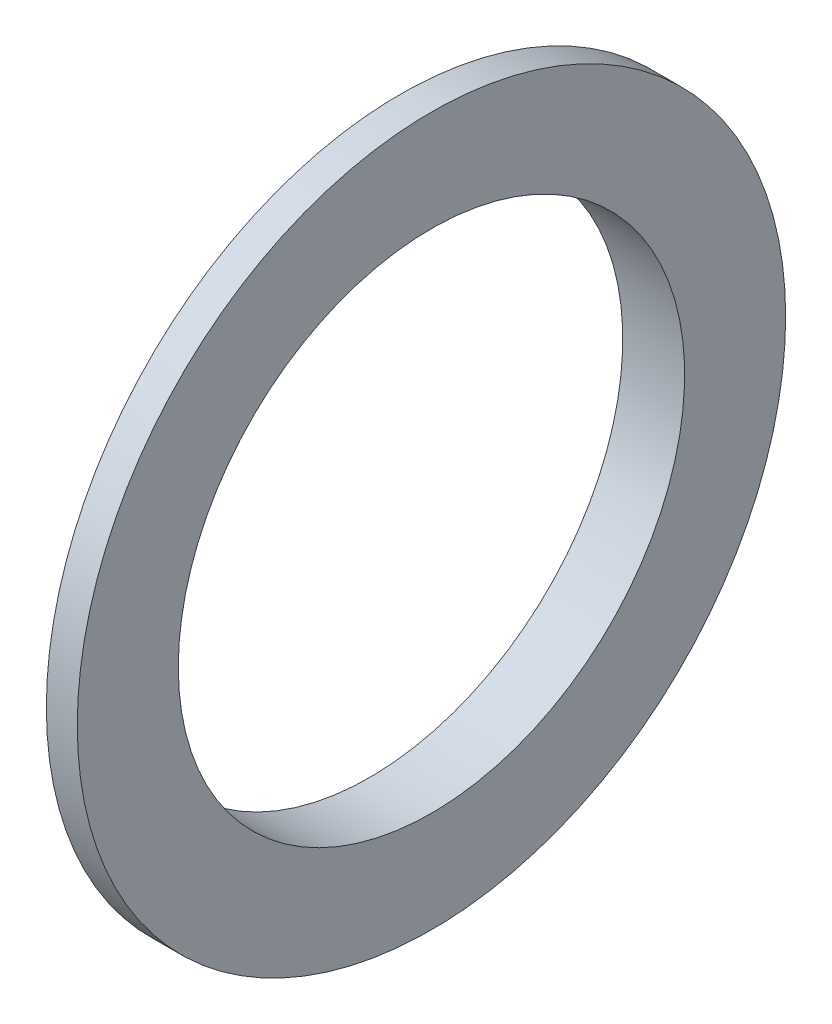
ISO-10303-21;
HEADER;
FILE_DESCRIPTION(('STEP AP214'),'2;1');
FILE_NAME('part.step','',(''),(''),'','','');
FILE_SCHEMA(('AUTOMOTIVE_DESIGN { 1 0 10303 214 1 1 1 1 }'));
ENDSEC;
DATA;
#1=APPLICATION_CONTEXT('core data for automotive mechanical design processes');
#2=APPLICATION_PROTOCOL_DEFINITION('international standard','automotive_design',2000,#1);
#3=PRODUCT_CONTEXT('',#1,'mechanical');
#4=PRODUCT('Part','Part','',(#3));
#5=PRODUCT_RELATED_PRODUCT_CATEGORY('part','',(#4));
#6=PRODUCT_DEFINITION_FORMATION('','',#4);
#7=PRODUCT_DEFINITION_CONTEXT('part definition',#1,'design');
#8=PRODUCT_DEFINITION('design','',#6,#7);
#9=PRODUCT_DEFINITION_SHAPE('','',#8);
#10=(LENGTH_UNIT() NAMED_UNIT(*) SI_UNIT(.MILLI.,.METRE.));
#11=(NAMED_UNIT(*) PLANE_ANGLE_UNIT() SI_UNIT($,.RADIAN.));
#12=(NAMED_UNIT(*) SI_UNIT($,.STERADIAN.) SOLID_ANGLE_UNIT());
#13=UNCERTAINTY_MEASURE_WITH_UNIT(LENGTH_MEASURE(1.E-05),#10,'distance_accuracy_value','');
#14=(GEOMETRIC_REPRESENTATION_CONTEXT(3) GLOBAL_UNCERTAINTY_ASSIGNED_CONTEXT((#13)) GLOBAL_UNIT_ASSIGNED_CONTEXT((#10,
#11,#12)) REPRESENTATION_CONTEXT('',''));
#15=CARTESIAN_POINT('',(0.,0.,0.));
#16=DIRECTION('',(0.,0.,1.));
#17=DIRECTION('',(1.,0.,0.));
#18=AXIS2_PLACEMENT_3D('',#15,#16,#17);
#19=CARTESIAN_POINT('',(-12.0675062027476,0.,26.9930945986634));
#20=DIRECTION('',(-1.,0.,0.));
#21=DIRECTION('',(0.,0.,1.));
#22=AXIS2_PLACEMENT_3D('',#19,#20,#21);
#23=CYLINDRICAL_SURFACE('',#22,43.2261625659578);
#24=CARTESIAN_POINT('',(-8.73505679111022,0.,26.9930945986634));
#25=DIRECTION('',(-1.,0.,0.));
#26=DIRECTION('',(0.,0.,1.));
#27=AXIS2_PLACEMENT_3D('',#24,#25,#26);
#28=CIRCLE('',#27,43.2261625659578);
#29=CARTESIAN_POINT('',(-8.73505679111022,0.,70.2192571646212));
#30=VERTEX_POINT('',#29);
#31=EDGE_CURVE('E10',#30,#30,#28,.T.);
#32=ORIENTED_EDGE('',*,*,#31,.F.);
#33=EDGE_LOOP('',(#32));
#34=FACE_BOUND('',#33,.T.);
#35=CARTESIAN_POINT('',(-4.36752839555511,0.,26.9930945986634));
#36=DIRECTION('',(-1.,0.,0.));
#37=DIRECTION('',(0.,0.,1.));
#38=AXIS2_PLACEMENT_3D('',#35,#36,#37);
#39=CIRCLE('',#38,43.2261625659578);
#40=CARTESIAN_POINT('',(-4.36752839555511,0.,70.2192571646212));
#41=VERTEX_POINT('',#40);
#42=EDGE_CURVE('E64',#41,#41,#39,.T.);
#43=ORIENTED_EDGE('',*,*,#42,.T.);
#44=EDGE_LOOP('',(#43));
#45=FACE_BOUND('',#44,.T.);
#46=ADVANCED_FACE('F37',(#34,#45),#23,.T.);
#47=CARTESIAN_POINT('',(-8.73505679111022,0.,-16.2330679672944));
#48=DIRECTION('',(1.,0.,0.));
#49=DIRECTION('',(0.,0.,-1.));
#50=AXIS2_PLACEMENT_3D('',#47,#48,#49);
#51=PLANE('',#50);
#52=CARTESIAN_POINT('',(-8.73505679111022,0.,26.9930945986634));
#53=DIRECTION('',(-1.,0.,0.));
#54=DIRECTION('',(0.,0.,1.));
#55=AXIS2_PLACEMENT_3D('',#52,#53,#54);
#56=CIRCLE('',#55,35.7410012177578);
#57=CARTESIAN_POINT('',(-8.73505679111022,0.,62.7340958164211));
#58=VERTEX_POINT('',#57);
#59=EDGE_CURVE('E44',#58,#58,#56,.T.);
#60=ORIENTED_EDGE('',*,*,#59,.F.);
#61=EDGE_LOOP('',(#60));
#62=FACE_BOUND('',#61,.T.);
#63=ORIENTED_EDGE('',*,*,#31,.T.);
#64=EDGE_LOOP('',(#63));
#65=FACE_BOUND('',#64,.T.);
#66=ADVANCED_FACE('F90',(#62,#65),#51,.F.);
#67=CARTESIAN_POINT('',(-12.0675062027476,0.,26.9930945986634));
#68=DIRECTION('',(-1.,0.,0.));
#69=DIRECTION('',(0.,0.,1.));
#70=AXIS2_PLACEMENT_3D('',#67,#68,#69);
#71=CYLINDRICAL_SURFACE('',#70,35.7410012177578);
#72=CARTESIAN_POINT('',(0.,0.,26.9930945986634));
#73=DIRECTION('',(-1.,0.,0.));
#74=DIRECTION('',(0.,0.,1.));
#75=AXIS2_PLACEMENT_3D('',#72,#73,#74);
#76=CIRCLE('',#75,35.7410012177578);
#77=CARTESIAN_POINT('',(0.,0.,62.7340958164211));
#78=VERTEX_POINT('',#77);
#79=EDGE_CURVE('E49',#78,#78,#76,.T.);
#80=ORIENTED_EDGE('',*,*,#79,.F.);
#81=EDGE_LOOP('',(#80));
#82=FACE_BOUND('',#81,.T.);
#83=ORIENTED_EDGE('',*,*,#59,.T.);
#84=EDGE_LOOP('',(#83));
#85=FACE_BOUND('',#84,.T.);
#86=ADVANCED_FACE('F85',(#82,#85),#71,.F.);
#87=CARTESIAN_POINT('',(0.,0.,-8.74790661909438));
#88=DIRECTION('',(-1.,0.,0.));
#89=DIRECTION('',(0.,0.,1.));
#90=AXIS2_PLACEMENT_3D('',#87,#88,#89);
#91=PLANE('',#90);
#92=CARTESIAN_POINT('',(0.,0.,26.9930945986634));
#93=DIRECTION('',(-1.,0.,0.));
#94=DIRECTION('',(0.,0.,1.));
#95=AXIS2_PLACEMENT_3D('',#92,#93,#94);
#96=CIRCLE('',#95,50.);
#97=CARTESIAN_POINT('',(0.,0.,76.9930945986634));
#98=VERTEX_POINT('',#97);
#99=EDGE_CURVE('E54',#98,#98,#96,.T.);
#100=ORIENTED_EDGE('',*,*,#99,.F.);
#101=EDGE_LOOP('',(#100));
#102=FACE_BOUND('',#101,.T.);
#103=ORIENTED_EDGE('',*,*,#79,.T.);
#104=EDGE_LOOP('',(#103));
#105=FACE_BOUND('',#104,.T.);
#106=ADVANCED_FACE('F79',(#102,#105),#91,.F.);
#107=CARTESIAN_POINT('',(-12.0675062027476,0.,26.9930945986634));
#108=DIRECTION('',(-1.,0.,0.));
#109=DIRECTION('',(0.,0.,1.));
#110=AXIS2_PLACEMENT_3D('',#107,#108,#109);
#111=CYLINDRICAL_SURFACE('',#110,50.);
#112=CARTESIAN_POINT('',(-4.36752839555511,0.,26.9930945986634));
#113=DIRECTION('',(-1.,0.,0.));
#114=DIRECTION('',(0.,0.,1.));
#115=AXIS2_PLACEMENT_3D('',#112,#113,#114);
#116=CIRCLE('',#115,50.);
#117=CARTESIAN_POINT('',(-4.36752839555511,0.,76.9930945986634));
#118=VERTEX_POINT('',#117);
#119=EDGE_CURVE('E60',#118,#118,#116,.T.);
#120=ORIENTED_EDGE('',*,*,#119,.F.);
#121=EDGE_LOOP('',(#120));
#122=FACE_BOUND('',#121,.T.);
#123=ORIENTED_EDGE('',*,*,#99,.T.);
#124=EDGE_LOOP('',(#123));
#125=FACE_BOUND('',#124,.T.);
#126=ADVANCED_FACE('F73',(#122,#125),#111,.T.);
#127=CARTESIAN_POINT('',(-4.36752839555511,0.,-16.2330679672944));
#128=DIRECTION('',(1.,0.,0.));
#129=DIRECTION('',(0.,0.,-1.));
#130=AXIS2_PLACEMENT_3D('',#127,#128,#129);
#131=PLANE('',#130);
#132=ORIENTED_EDGE('',*,*,#42,.F.);
#133=EDGE_LOOP('',(#132));
#134=FACE_BOUND('',#133,.T.);
#135=ORIENTED_EDGE('',*,*,#119,.T.);
#136=EDGE_LOOP('',(#135));
#137=FACE_BOUND('',#136,.T.);
#138=ADVANCED_FACE('F70',(#134,#137),#131,.F.);
#139=CLOSED_SHELL('',(#46,#66,#86,#106,#126,#138));
#140=MANIFOLD_SOLID_BREP('B2',#139);
#141=ADVANCED_BREP_SHAPE_REPRESENTATION('',(#18,#140),#14);
#142=SHAPE_DEFINITION_REPRESENTATION(#9,#141);
ENDSEC;
END-ISO-10303-21;
